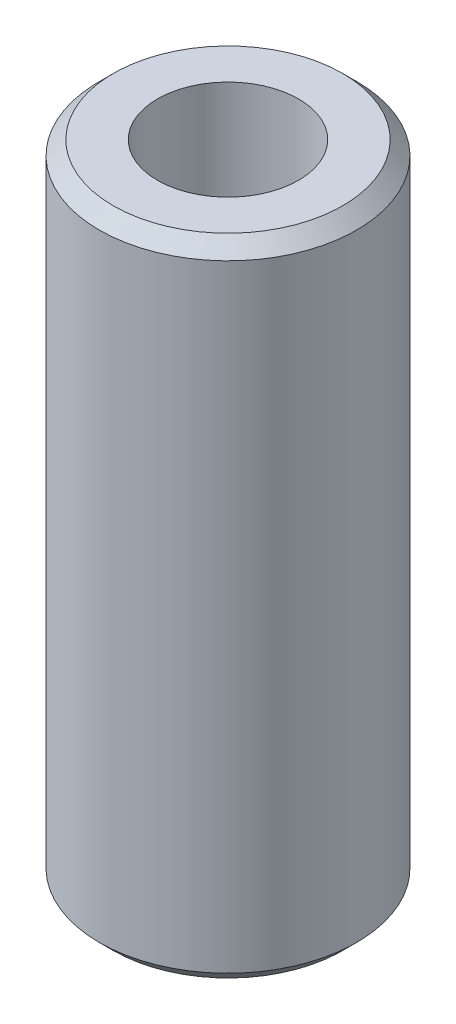
ISO-10303-21;
HEADER;
FILE_DESCRIPTION(('STEP AP214'),'2;1');
FILE_NAME('part.step','',(''),(''),'','','');
FILE_SCHEMA(('AUTOMOTIVE_DESIGN { 1 0 10303 214 1 1 1 1 }'));
ENDSEC;
DATA;
#1=APPLICATION_CONTEXT('core data for automotive mechanical design processes');
#2=APPLICATION_PROTOCOL_DEFINITION('international standard','automotive_design',2000,#1);
#3=PRODUCT_CONTEXT('',#1,'mechanical');
#4=PRODUCT('Part','Part','',(#3));
#5=PRODUCT_RELATED_PRODUCT_CATEGORY('part','',(#4));
#6=PRODUCT_DEFINITION_FORMATION('','',#4);
#7=PRODUCT_DEFINITION_CONTEXT('part definition',#1,'design');
#8=PRODUCT_DEFINITION('design','',#6,#7);
#9=PRODUCT_DEFINITION_SHAPE('','',#8);
#10=(LENGTH_UNIT() NAMED_UNIT(*) SI_UNIT(.MILLI.,.METRE.));
#11=(NAMED_UNIT(*) PLANE_ANGLE_UNIT() SI_UNIT($,.RADIAN.));
#12=(NAMED_UNIT(*) SI_UNIT($,.STERADIAN.) SOLID_ANGLE_UNIT());
#13=UNCERTAINTY_MEASURE_WITH_UNIT(LENGTH_MEASURE(1.E-05),#10,'distance_accuracy_value','');
#14=(GEOMETRIC_REPRESENTATION_CONTEXT(3) GLOBAL_UNCERTAINTY_ASSIGNED_CONTEXT((#13)) GLOBAL_UNIT_ASSIGNED_CONTEXT((#10,
#11,#12)) REPRESENTATION_CONTEXT('',''));
#15=CARTESIAN_POINT('',(0.,0.,0.));
#16=DIRECTION('',(0.,0.,1.));
#17=DIRECTION('',(1.,0.,0.));
#18=AXIS2_PLACEMENT_3D('',#15,#16,#17);
#19=CARTESIAN_POINT('',(0.,125.306860110782,0.));
#20=DIRECTION('',(0.,-1.,0.));
#21=DIRECTION('',(0.,0.,-1.));
#22=AXIS2_PLACEMENT_3D('',#19,#20,#21);
#23=CYLINDRICAL_SURFACE('',#22,25.);
#24=CARTESIAN_POINT('',(0.,122.585737749058,0.));
#25=DIRECTION('',(0.,1.,0.));
#26=DIRECTION('',(0.,0.,1.));
#27=AXIS2_PLACEMENT_3D('',#24,#25,#26);
#28=CIRCLE('',#27,25.);
#29=CARTESIAN_POINT('',(0.,122.585737749058,25.));
#30=VERTEX_POINT('',#29);
#31=EDGE_CURVE('E50',#30,#30,#28,.F.);
#32=ORIENTED_EDGE('',*,*,#31,.T.);
#33=EDGE_LOOP('',(#32));
#34=FACE_BOUND('',#33,.T.);
#35=CARTESIAN_POINT('',(0.,2.72112236172392,0.));
#36=DIRECTION('',(0.,1.,0.));
#37=DIRECTION('',(0.,0.,1.));
#38=AXIS2_PLACEMENT_3D('',#35,#36,#37);
#39=CIRCLE('',#38,25.);
#40=CARTESIAN_POINT('',(0.,2.72112236172392,25.));
#41=VERTEX_POINT('',#40);
#42=EDGE_CURVE('E51',#41,#41,#39,.T.);
#43=ORIENTED_EDGE('',*,*,#42,.T.);
#44=EDGE_LOOP('',(#43));
#45=FACE_BOUND('',#44,.T.);
#46=ADVANCED_FACE('F39',(#34,#45),#23,.T.);
#47=CARTESIAN_POINT('',(0.,125.306860110782,0.));
#48=DIRECTION('',(0.,1.,0.));
#49=DIRECTION('',(0.,0.,1.));
#50=AXIS2_PLACEMENT_3D('',#47,#48,#49);
#51=PLANE('',#50);
#52=CARTESIAN_POINT('',(0.,125.306860110782,0.));
#53=DIRECTION('',(0.,1.,0.));
#54=DIRECTION('',(0.,0.,1.));
#55=AXIS2_PLACEMENT_3D('',#52,#53,#54);
#56=CIRCLE('',#55,22.2788776382761);
#57=CARTESIAN_POINT('',(0.,125.306860110782,22.2788776382761));
#58=VERTEX_POINT('',#57);
#59=EDGE_CURVE('E54',#58,#58,#56,.T.);
#60=ORIENTED_EDGE('',*,*,#59,.T.);
#61=EDGE_LOOP('',(#60));
#62=FACE_BOUND('',#61,.T.);
#63=CARTESIAN_POINT('',(0.,125.306860110782,0.));
#64=DIRECTION('',(0.,1.,0.));
#65=DIRECTION('',(0.,0.,1.));
#66=AXIS2_PLACEMENT_3D('',#63,#64,#65);
#67=CIRCLE('',#66,13.7051104025088);
#68=CARTESIAN_POINT('',(0.,125.306860110782,13.7051104025088));
#69=VERTEX_POINT('',#68);
#70=EDGE_CURVE('E58',#69,#69,#67,.T.);
#71=ORIENTED_EDGE('',*,*,#70,.F.);
#72=EDGE_LOOP('',(#71));
#73=FACE_BOUND('',#72,.T.);
#74=ADVANCED_FACE('F69',(#62,#73),#51,.T.);
#75=CARTESIAN_POINT('',(0.,0.,0.));
#76=DIRECTION('',(0.,1.,0.));
#77=DIRECTION('',(0.,0.,1.));
#78=AXIS2_PLACEMENT_3D('',#75,#76,#77);
#79=PLANE('',#78);
#80=CARTESIAN_POINT('',(0.,0.,0.));
#81=DIRECTION('',(0.,1.,0.));
#82=DIRECTION('',(0.,0.,1.));
#83=AXIS2_PLACEMENT_3D('',#80,#81,#82);
#84=CIRCLE('',#83,22.2788776382761);
#85=CARTESIAN_POINT('',(0.,0.,22.2788776382761));
#86=VERTEX_POINT('',#85);
#87=EDGE_CURVE('E10',#86,#86,#84,.F.);
#88=ORIENTED_EDGE('',*,*,#87,.T.);
#89=EDGE_LOOP('',(#88));
#90=FACE_BOUND('',#89,.T.);
#91=CARTESIAN_POINT('',(0.,0.,0.));
#92=DIRECTION('',(0.,1.,0.));
#93=DIRECTION('',(0.,0.,1.));
#94=AXIS2_PLACEMENT_3D('',#91,#92,#93);
#95=CIRCLE('',#94,13.7051104025088);
#96=CARTESIAN_POINT('',(0.,0.,13.7051104025088));
#97=VERTEX_POINT('',#96);
#98=EDGE_CURVE('E63',#97,#97,#95,.T.);
#99=ORIENTED_EDGE('',*,*,#98,.T.);
#100=EDGE_LOOP('',(#99));
#101=FACE_BOUND('',#100,.T.);
#102=ADVANCED_FACE('F75',(#90,#101),#79,.F.);
#103=CARTESIAN_POINT('',(0.,125.306860110782,0.));
#104=DIRECTION('',(0.,-1.,0.));
#105=DIRECTION('',(0.,0.,-1.));
#106=AXIS2_PLACEMENT_3D('',#103,#104,#105);
#107=CYLINDRICAL_SURFACE('',#106,13.7051104025088);
#108=ORIENTED_EDGE('',*,*,#70,.T.);
#109=EDGE_LOOP('',(#108));
#110=FACE_BOUND('',#109,.T.);
#111=ORIENTED_EDGE('',*,*,#98,.F.);
#112=EDGE_LOOP('',(#111));
#113=FACE_BOUND('',#112,.T.);
#114=ADVANCED_FACE('F70',(#110,#113),#107,.F.);
#115=CARTESIAN_POINT('',(0.,125.306860110782,0.));
#116=DIRECTION('',(0.,-1.,0.));
#117=DIRECTION('',(0.,0.,-1.));
#118=AXIS2_PLACEMENT_3D('',#115,#116,#117);
#119=CONICAL_SURFACE('',#118,22.2788776382761,0.78539816339745);
#120=ORIENTED_EDGE('',*,*,#31,.F.);
#121=EDGE_LOOP('',(#120));
#122=FACE_BOUND('',#121,.T.);
#123=ORIENTED_EDGE('',*,*,#59,.F.);
#124=EDGE_LOOP('',(#123));
#125=FACE_BOUND('',#124,.T.);
#126=ADVANCED_FACE('F81',(#122,#125),#119,.T.);
#127=CARTESIAN_POINT('',(0.,2.72112236172392,0.));
#128=DIRECTION('',(0.,1.,0.));
#129=DIRECTION('',(0.,0.,1.));
#130=AXIS2_PLACEMENT_3D('',#127,#128,#129);
#131=CONICAL_SURFACE('',#130,25.,0.785398163397449);
#132=ORIENTED_EDGE('',*,*,#87,.F.);
#133=EDGE_LOOP('',(#132));
#134=FACE_BOUND('',#133,.T.);
#135=ORIENTED_EDGE('',*,*,#42,.F.);
#136=EDGE_LOOP('',(#135));
#137=FACE_BOUND('',#136,.T.);
#138=ADVANCED_FACE('F45',(#134,#137),#131,.T.);
#139=CLOSED_SHELL('',(#46,#74,#102,#114,#126,#138));
#140=MANIFOLD_SOLID_BREP('B2',#139);
#141=ADVANCED_BREP_SHAPE_REPRESENTATION('',(#18,#140),#14);
#142=SHAPE_DEFINITION_REPRESENTATION(#9,#141);
ENDSEC;
END-ISO-10303-21;
